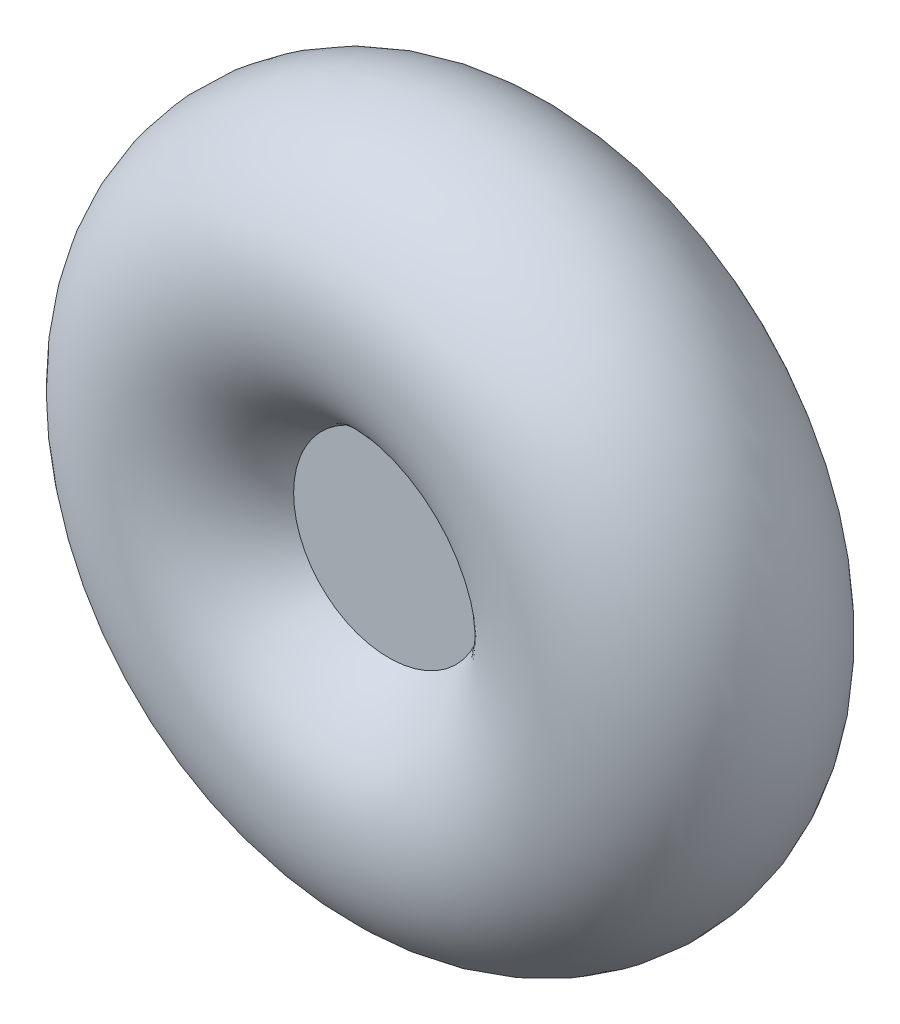
ISO-10303-21;
HEADER;
FILE_DESCRIPTION(('STEP AP214'),'2;1');
FILE_NAME('part.step','',(''),(''),'','','');
FILE_SCHEMA(('AUTOMOTIVE_DESIGN { 1 0 10303 214 1 1 1 1 }'));
ENDSEC;
DATA;
#1=APPLICATION_CONTEXT('core data for automotive mechanical design processes');
#2=APPLICATION_PROTOCOL_DEFINITION('international standard','automotive_design',2000,#1);
#3=PRODUCT_CONTEXT('',#1,'mechanical');
#4=PRODUCT('Part','Part','',(#3));
#5=PRODUCT_RELATED_PRODUCT_CATEGORY('part','',(#4));
#6=PRODUCT_DEFINITION_FORMATION('','',#4);
#7=PRODUCT_DEFINITION_CONTEXT('part definition',#1,'design');
#8=PRODUCT_DEFINITION('design','',#6,#7);
#9=PRODUCT_DEFINITION_SHAPE('','',#8);
#10=(LENGTH_UNIT() NAMED_UNIT(*) SI_UNIT(.MILLI.,.METRE.));
#11=(NAMED_UNIT(*) PLANE_ANGLE_UNIT() SI_UNIT($,.RADIAN.));
#12=(NAMED_UNIT(*) SI_UNIT($,.STERADIAN.) SOLID_ANGLE_UNIT());
#13=UNCERTAINTY_MEASURE_WITH_UNIT(LENGTH_MEASURE(1.E-05),#10,'distance_accuracy_value','');
#14=(GEOMETRIC_REPRESENTATION_CONTEXT(3) GLOBAL_UNCERTAINTY_ASSIGNED_CONTEXT((#13)) GLOBAL_UNIT_ASSIGNED_CONTEXT((#10,
#11,#12)) REPRESENTATION_CONTEXT('',''));
#15=CARTESIAN_POINT('',(0.,0.,0.));
#16=DIRECTION('',(0.,0.,1.));
#17=DIRECTION('',(1.,0.,0.));
#18=AXIS2_PLACEMENT_3D('',#15,#16,#17);
#19=CARTESIAN_POINT('',(0.,0.,0.));
#20=DIRECTION('',(0.,0.,-1.));
#21=DIRECTION('',(-1.,0.,0.));
#22=AXIS2_PLACEMENT_3D('',#19,#20,#21);
#23=TOROIDAL_SURFACE('',#22,33.2094911143519,20.7655088856481);
#24=CARTESIAN_POINT('',(0.,0.,9.50290159395817));
#25=DIRECTION('',(0.,0.,-1.));
#26=DIRECTION('',(-1.,0.,0.));
#27=AXIS2_PLACEMENT_3D('',#24,#25,#26);
#28=CIRCLE('',#27,14.7459805983238);
#29=CARTESIAN_POINT('',(-14.7459805983238,0.,9.50290159395817));
#30=VERTEX_POINT('',#29);
#31=EDGE_CURVE('E10',#30,#30,#28,.T.);
#32=ORIENTED_EDGE('',*,*,#31,.T.);
#33=EDGE_LOOP('',(#32));
#34=FACE_BOUND('',#33,.T.);
#35=CARTESIAN_POINT('',(0.,0.,-9.50290159395817));
#36=DIRECTION('',(0.,0.,-1.));
#37=DIRECTION('',(-1.,0.,0.));
#38=AXIS2_PLACEMENT_3D('',#35,#36,#37);
#39=CIRCLE('',#38,14.7459805983238);
#40=CARTESIAN_POINT('',(-14.7459805983238,0.,-9.50290159395817));
#41=VERTEX_POINT('',#40);
#42=EDGE_CURVE('E49',#41,#41,#39,.T.);
#43=ORIENTED_EDGE('',*,*,#42,.F.);
#44=EDGE_LOOP('',(#43));
#45=FACE_BOUND('',#44,.T.);
#46=ADVANCED_FACE('F43',(#34,#45),#23,.T.);
#47=CARTESIAN_POINT('',(0.,0.,9.50290159395817));
#48=DIRECTION('',(0.,0.,-1.));
#49=DIRECTION('',(-1.,0.,0.));
#50=AXIS2_PLACEMENT_3D('',#47,#48,#49);
#51=PLANE('',#50);
#52=ORIENTED_EDGE('',*,*,#31,.F.);
#53=EDGE_LOOP('',(#52));
#54=FACE_BOUND('',#53,.T.);
#55=ADVANCED_FACE('F58',(#54),#51,.F.);
#56=CARTESIAN_POINT('',(0.,0.,-9.50290159395817));
#57=DIRECTION('',(0.,0.,-1.));
#58=DIRECTION('',(-1.,0.,0.));
#59=AXIS2_PLACEMENT_3D('',#56,#57,#58);
#60=PLANE('',#59);
#61=ORIENTED_EDGE('',*,*,#42,.T.);
#62=EDGE_LOOP('',(#61));
#63=FACE_BOUND('',#62,.T.);
#64=ADVANCED_FACE('F55',(#63),#60,.T.);
#65=CLOSED_SHELL('',(#46,#55,#64));
#66=MANIFOLD_SOLID_BREP('B2',#65);
#67=ADVANCED_BREP_SHAPE_REPRESENTATION('',(#18,#66),#14);
#68=SHAPE_DEFINITION_REPRESENTATION(#9,#67);
ENDSEC;
END-ISO-10303-21;
